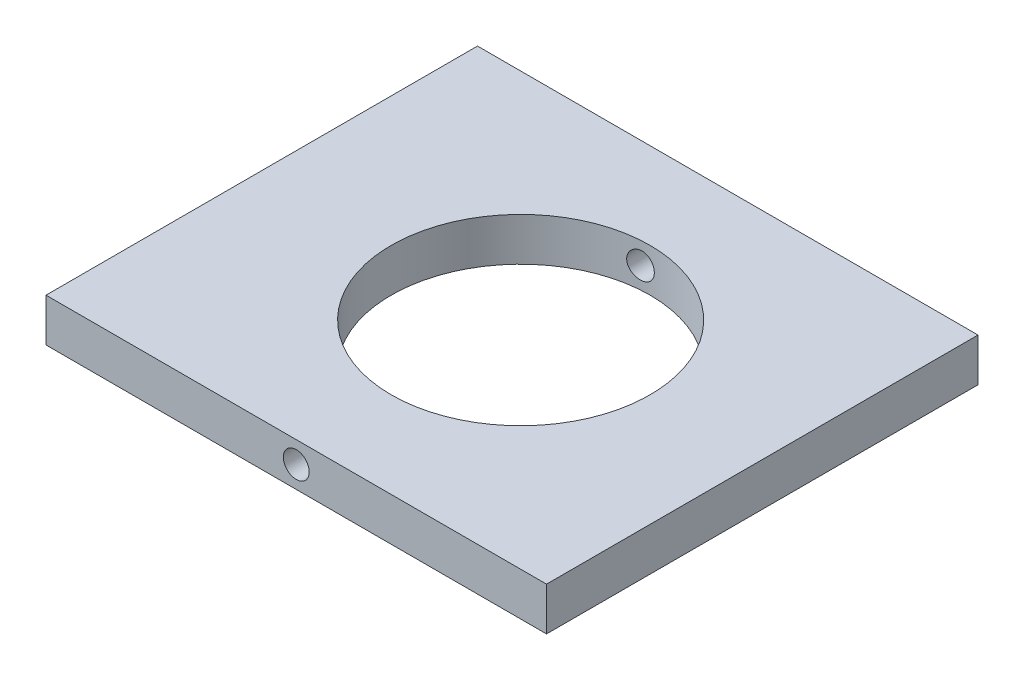
ISO-10303-21;
HEADER;
FILE_DESCRIPTION(('STEP AP214'),'2;1');
FILE_NAME('part.step','',(''),(''),'','','');
FILE_SCHEMA(('AUTOMOTIVE_DESIGN { 1 0 10303 214 1 1 1 1 }'));
ENDSEC;
DATA;
#1=APPLICATION_CONTEXT('core data for automotive mechanical design processes');
#2=APPLICATION_PROTOCOL_DEFINITION('international standard','automotive_design',2000,#1);
#3=PRODUCT_CONTEXT('',#1,'mechanical');
#4=PRODUCT('Part','Part','',(#3));
#5=PRODUCT_RELATED_PRODUCT_CATEGORY('part','',(#4));
#6=PRODUCT_DEFINITION_FORMATION('','',#4);
#7=PRODUCT_DEFINITION_CONTEXT('part definition',#1,'design');
#8=PRODUCT_DEFINITION('design','',#6,#7);
#9=PRODUCT_DEFINITION_SHAPE('','',#8);
#10=(LENGTH_UNIT() NAMED_UNIT(*) SI_UNIT(.MILLI.,.METRE.));
#11=(NAMED_UNIT(*) PLANE_ANGLE_UNIT() SI_UNIT($,.RADIAN.));
#12=(NAMED_UNIT(*) SI_UNIT($,.STERADIAN.) SOLID_ANGLE_UNIT());
#13=UNCERTAINTY_MEASURE_WITH_UNIT(LENGTH_MEASURE(1.E-05),#10,'distance_accuracy_value','');
#14=(GEOMETRIC_REPRESENTATION_CONTEXT(3) GLOBAL_UNCERTAINTY_ASSIGNED_CONTEXT((#13)) GLOBAL_UNIT_ASSIGNED_CONTEXT((#10,
#11,#12)) REPRESENTATION_CONTEXT('',''));
#15=CARTESIAN_POINT('',(0.,0.,0.));
#16=DIRECTION('',(0.,0.,1.));
#17=DIRECTION('',(1.,0.,0.));
#18=AXIS2_PLACEMENT_3D('',#15,#16,#17);
#19=CARTESIAN_POINT('',(-5.5,-45.,50.));
#20=DIRECTION('',(1.,0.,0.));
#21=DIRECTION('',(0.,0.,-1.));
#22=AXIS2_PLACEMENT_3D('',#19,#20,#21);
#23=PLANE('',#22);
#24=DIRECTION('',(0.,-1.,0.));
#25=VECTOR('',#24,1.);
#26=CARTESIAN_POINT('',(-5.5,-45.,0.));
#27=LINE('',#26,#25);
#28=CARTESIAN_POINT('',(-5.5,-45.,0.));
#29=VERTEX_POINT('',#28);
#30=CARTESIAN_POINT('',(-5.5,-50.,0.));
#31=VERTEX_POINT('',#30);
#32=EDGE_CURVE('E108',#29,#31,#27,.T.);
#33=ORIENTED_EDGE('',*,*,#32,.T.);
#34=DIRECTION('',(0.,0.,-1.));
#35=VECTOR('',#34,1.);
#36=CARTESIAN_POINT('',(-5.5,-50.,50.));
#37=LINE('',#36,#35);
#38=CARTESIAN_POINT('',(-5.5,-50.,50.));
#39=VERTEX_POINT('',#38);
#40=EDGE_CURVE('E11',#39,#31,#37,.T.);
#41=ORIENTED_EDGE('',*,*,#40,.F.);
#42=DIRECTION('',(0.,-1.,0.));
#43=VECTOR('',#42,1.);
#44=CARTESIAN_POINT('',(-5.5,-45.,50.));
#45=LINE('',#44,#43);
#46=CARTESIAN_POINT('',(-5.5,-45.,50.));
#47=VERTEX_POINT('',#46);
#48=EDGE_CURVE('E93',#47,#39,#45,.T.);
#49=ORIENTED_EDGE('',*,*,#48,.F.);
#50=DIRECTION('',(0.,0.,-1.));
#51=VECTOR('',#50,1.);
#52=CARTESIAN_POINT('',(-5.5,-45.,50.));
#53=LINE('',#52,#51);
#54=EDGE_CURVE('E60',#47,#29,#53,.T.);
#55=ORIENTED_EDGE('',*,*,#54,.T.);
#56=EDGE_LOOP('',(#33,#41,#49,#55));
#57=FACE_BOUND('',#56,.T.);
#58=ADVANCED_FACE('F37',(#57),#23,.F.);
#59=CARTESIAN_POINT('',(-5.5,-50.,50.));
#60=DIRECTION('',(0.,1.,0.));
#61=DIRECTION('',(0.,0.,1.));
#62=AXIS2_PLACEMENT_3D('',#59,#60,#61);
#63=PLANE('',#62);
#64=CARTESIAN_POINT('',(24.5,-50.,25.));
#65=DIRECTION('',(0.,1.,0.));
#66=DIRECTION('',(0.,0.,1.));
#67=AXIS2_PLACEMENT_3D('',#64,#65,#66);
#68=CIRCLE('',#67,15.);
#69=CARTESIAN_POINT('',(24.5,-50.,40.));
#70=VERTEX_POINT('',#69);
#71=EDGE_CURVE('E110',#70,#70,#68,.T.);
#72=ORIENTED_EDGE('',*,*,#71,.T.);
#73=EDGE_LOOP('',(#72));
#74=FACE_BOUND('',#73,.T.);
#75=DIRECTION('',(1.,0.,0.));
#76=VECTOR('',#75,1.);
#77=CARTESIAN_POINT('',(-5.5,-50.,0.));
#78=LINE('',#77,#76);
#79=CARTESIAN_POINT('',(52.5,-50.,0.));
#80=VERTEX_POINT('',#79);
#81=EDGE_CURVE('E98',#31,#80,#78,.T.);
#82=ORIENTED_EDGE('',*,*,#81,.T.);
#83=DIRECTION('',(0.,0.,-1.));
#84=VECTOR('',#83,1.);
#85=CARTESIAN_POINT('',(52.5,-50.,50.));
#86=LINE('',#85,#84);
#87=CARTESIAN_POINT('',(52.5,-50.,50.));
#88=VERTEX_POINT('',#87);
#89=EDGE_CURVE('E51',#88,#80,#86,.T.);
#90=ORIENTED_EDGE('',*,*,#89,.F.);
#91=DIRECTION('',(1.,0.,0.));
#92=VECTOR('',#91,1.);
#93=CARTESIAN_POINT('',(-5.5,-50.,50.));
#94=LINE('',#93,#92);
#95=EDGE_CURVE('E85',#39,#88,#94,.T.);
#96=ORIENTED_EDGE('',*,*,#95,.F.);
#97=ORIENTED_EDGE('',*,*,#40,.T.);
#98=EDGE_LOOP('',(#82,#90,#96,#97));
#99=FACE_BOUND('',#98,.T.);
#100=ADVANCED_FACE('F97',(#74,#99),#63,.F.);
#101=CARTESIAN_POINT('',(52.5,-45.,50.));
#102=DIRECTION('',(1.,0.,0.));
#103=DIRECTION('',(0.,0.,-1.));
#104=AXIS2_PLACEMENT_3D('',#101,#102,#103);
#105=PLANE('',#104);
#106=DIRECTION('',(0.,-1.,0.));
#107=VECTOR('',#106,1.);
#108=CARTESIAN_POINT('',(52.5,-45.,0.));
#109=LINE('',#108,#107);
#110=CARTESIAN_POINT('',(52.5,-45.,0.));
#111=VERTEX_POINT('',#110);
#112=EDGE_CURVE('E112',#111,#80,#109,.T.);
#113=ORIENTED_EDGE('',*,*,#112,.F.);
#114=DIRECTION('',(0.,0.,-1.));
#115=VECTOR('',#114,1.);
#116=CARTESIAN_POINT('',(52.5,-45.,50.));
#117=LINE('',#116,#115);
#118=CARTESIAN_POINT('',(52.5,-45.,50.));
#119=VERTEX_POINT('',#118);
#120=EDGE_CURVE('E74',#119,#111,#117,.T.);
#121=ORIENTED_EDGE('',*,*,#120,.F.);
#122=DIRECTION('',(0.,-1.,0.));
#123=VECTOR('',#122,1.);
#124=CARTESIAN_POINT('',(52.5,-45.,50.));
#125=LINE('',#124,#123);
#126=EDGE_CURVE('E92',#119,#88,#125,.T.);
#127=ORIENTED_EDGE('',*,*,#126,.T.);
#128=ORIENTED_EDGE('',*,*,#89,.T.);
#129=EDGE_LOOP('',(#113,#121,#127,#128));
#130=FACE_BOUND('',#129,.T.);
#131=ADVANCED_FACE('F102',(#130),#105,.T.);
#132=CARTESIAN_POINT('',(-5.5,-45.,50.));
#133=DIRECTION('',(0.,1.,0.));
#134=DIRECTION('',(0.,0.,1.));
#135=AXIS2_PLACEMENT_3D('',#132,#133,#134);
#136=PLANE('',#135);
#137=CARTESIAN_POINT('',(24.5,-45.,25.));
#138=DIRECTION('',(0.,1.,0.));
#139=DIRECTION('',(0.,0.,1.));
#140=AXIS2_PLACEMENT_3D('',#137,#138,#139);
#141=CIRCLE('',#140,15.);
#142=CARTESIAN_POINT('',(24.5,-45.,40.));
#143=VERTEX_POINT('',#142);
#144=EDGE_CURVE('E172',#143,#143,#141,.T.);
#145=ORIENTED_EDGE('',*,*,#144,.F.);
#146=EDGE_LOOP('',(#145));
#147=FACE_BOUND('',#146,.T.);
#148=DIRECTION('',(1.,0.,0.));
#149=VECTOR('',#148,1.);
#150=CARTESIAN_POINT('',(-5.5,-45.,0.));
#151=LINE('',#150,#149);
#152=EDGE_CURVE('E114',#29,#111,#151,.T.);
#153=ORIENTED_EDGE('',*,*,#152,.F.);
#154=ORIENTED_EDGE('',*,*,#54,.F.);
#155=DIRECTION('',(1.,0.,0.));
#156=VECTOR('',#155,1.);
#157=CARTESIAN_POINT('',(-5.5,-45.,50.));
#158=LINE('',#157,#156);
#159=EDGE_CURVE('E103',#47,#119,#158,.T.);
#160=ORIENTED_EDGE('',*,*,#159,.T.);
#161=ORIENTED_EDGE('',*,*,#120,.T.);
#162=EDGE_LOOP('',(#153,#154,#160,#161));
#163=FACE_BOUND('',#162,.T.);
#164=ADVANCED_FACE('F146',(#147,#163),#136,.T.);
#165=CARTESIAN_POINT('',(0.,0.,50.));
#166=DIRECTION('',(0.,0.,1.));
#167=DIRECTION('',(1.,0.,0.));
#168=AXIS2_PLACEMENT_3D('',#165,#166,#167);
#169=PLANE('',#168);
#170=CARTESIAN_POINT('',(23.5,-47.5,50.));
#171=DIRECTION('',(0.,0.,1.));
#172=DIRECTION('',(1.,0.,0.));
#173=AXIS2_PLACEMENT_3D('',#170,#171,#172);
#174=CIRCLE('',#173,1.5);
#175=CARTESIAN_POINT('',(25.,-47.5,50.));
#176=VERTEX_POINT('',#175);
#177=EDGE_CURVE('E166',#176,#176,#174,.T.);
#178=ORIENTED_EDGE('',*,*,#177,.F.);
#179=EDGE_LOOP('',(#178));
#180=FACE_BOUND('',#179,.T.);
#181=ORIENTED_EDGE('',*,*,#48,.T.);
#182=ORIENTED_EDGE('',*,*,#95,.T.);
#183=ORIENTED_EDGE('',*,*,#126,.F.);
#184=ORIENTED_EDGE('',*,*,#159,.F.);
#185=EDGE_LOOP('',(#181,#182,#183,#184));
#186=FACE_BOUND('',#185,.T.);
#187=ADVANCED_FACE('F89',(#180,#186),#169,.T.);
#188=CARTESIAN_POINT('',(0.,0.,0.));
#189=DIRECTION('',(0.,0.,1.));
#190=DIRECTION('',(1.,0.,0.));
#191=AXIS2_PLACEMENT_3D('',#188,#189,#190);
#192=PLANE('',#191);
#193=CARTESIAN_POINT('',(23.5,-47.5,0.));
#194=DIRECTION('',(0.,0.,1.));
#195=DIRECTION('',(1.,0.,0.));
#196=AXIS2_PLACEMENT_3D('',#193,#194,#195);
#197=CIRCLE('',#196,1.5);
#198=CARTESIAN_POINT('',(25.,-47.5,0.));
#199=VERTEX_POINT('',#198);
#200=EDGE_CURVE('E123',#199,#199,#197,.T.);
#201=ORIENTED_EDGE('',*,*,#200,.T.);
#202=EDGE_LOOP('',(#201));
#203=FACE_BOUND('',#202,.T.);
#204=ORIENTED_EDGE('',*,*,#32,.F.);
#205=ORIENTED_EDGE('',*,*,#152,.T.);
#206=ORIENTED_EDGE('',*,*,#112,.T.);
#207=ORIENTED_EDGE('',*,*,#81,.F.);
#208=EDGE_LOOP('',(#204,#205,#206,#207));
#209=FACE_BOUND('',#208,.T.);
#210=ADVANCED_FACE('F145',(#203,#209),#192,.F.);
#211=CARTESIAN_POINT('',(24.5,-50.,25.));
#212=DIRECTION('',(0.,1.,0.));
#213=DIRECTION('',(0.,0.,1.));
#214=AXIS2_PLACEMENT_3D('',#211,#212,#213);
#215=CYLINDRICAL_SURFACE('',#214,15.);
#216=CARTESIAN_POINT('',(24.5,-48.6180339887499,40.));
#217=CARTESIAN_POINT('',(24.562792353238,-48.5618659776974,39.9999999273094));
#218=CARTESIAN_POINT('',(24.6208838158503,-48.5003581564799,39.9996043563319));
#219=CARTESIAN_POINT('',(24.72595981168,-48.3684181847015,39.9983905695386));
#220=CARTESIAN_POINT('',(24.772931785864,-48.2979760797655,39.9975718791152));
#221=CARTESIAN_POINT('',(24.8543649479623,-48.1502338072452,39.99586905058));
#222=CARTESIAN_POINT('',(24.8888319928025,-48.0729368714198,39.9949849433416));
#223=CARTESIAN_POINT('',(24.9442939822402,-47.9136720731185,39.9934445105049));
#224=CARTESIAN_POINT('',(24.9652921021757,-47.8317053165315,39.9927881312359));
#225=CARTESIAN_POINT('',(24.9932381044238,-47.6653852355015,39.991894956042));
#226=CARTESIAN_POINT('',(25.0001822524607,-47.5810312827931,39.9916582716361));
#227=CARTESIAN_POINT('',(24.9998104507153,-47.4123520030367,39.9916706731326));
#228=CARTESIAN_POINT('',(24.9924940082127,-47.3280266770783,39.9919197758194));
#229=CARTESIAN_POINT('',(24.9638161431028,-47.1618456026428,39.9928341984516));
#230=CARTESIAN_POINT('',(24.9424617981782,-47.0799886314014,39.9934993086447));
#231=CARTESIAN_POINT('',(24.8863217141132,-46.9210199569291,39.9950504711979));
#232=CARTESIAN_POINT('',(24.8515359006039,-46.8439082799752,39.9959365247814));
#233=CARTESIAN_POINT('',(24.7694988309606,-46.6965791515574,39.9976347173306));
#234=CARTESIAN_POINT('',(24.7222416725437,-46.6263649861101,39.9984468210528));
#235=CARTESIAN_POINT('',(24.6166083457938,-46.4948639816127,39.9996394624362));
#236=CARTESIAN_POINT('',(24.5582322156506,-46.4335771119016,40.0000200015798));
#237=CARTESIAN_POINT('',(24.4320393526911,-46.3216914820977,39.9999784211476));
#238=CARTESIAN_POINT('',(24.3642257106856,-46.2710892363641,39.9995565637883));
#239=CARTESIAN_POINT('',(24.2210799042835,-46.1819898565089,39.9975771087919));
#240=CARTESIAN_POINT('',(24.1457478960958,-46.1434924709536,39.9960195347473));
#241=CARTESIAN_POINT('',(23.9899180446766,-46.0797715112282,39.9915266586073));
#242=CARTESIAN_POINT('',(23.9094332194227,-46.0545158613062,39.988594718639));
#243=CARTESIAN_POINT('',(23.7454392678804,-46.0178328573119,39.9812339758208));
#244=CARTESIAN_POINT('',(23.6619301757651,-46.0064053470377,39.9768051898798));
#245=CARTESIAN_POINT('',(23.4943230369783,-45.9976665937383,39.9664845056108));
#246=CARTESIAN_POINT('',(23.4102254049045,-46.0003462508765,39.9605935527908));
#247=CARTESIAN_POINT('',(23.2437533596228,-46.0196756779531,39.9475355154578));
#248=CARTESIAN_POINT('',(23.1613790012947,-46.0363258921081,39.9403683903723));
#249=CARTESIAN_POINT('',(23.0002148174492,-46.0832096888632,39.9250539333135));
#250=CARTESIAN_POINT('',(22.9214460800378,-46.1135141218067,39.9169016530286));
#251=CARTESIAN_POINT('',(22.770129740452,-46.1868514276487,39.9001124404489));
#252=CARTESIAN_POINT('',(22.6975824694957,-46.229884977677,39.8914754823913));
#253=CARTESIAN_POINT('',(22.560210733606,-46.3278382495193,39.8742075878157));
#254=CARTESIAN_POINT('',(22.4954454068788,-46.3828410293132,39.865577139024));
#255=CARTESIAN_POINT('',(22.3760681607444,-46.5030290060947,39.8489916746371));
#256=CARTESIAN_POINT('',(22.321456317729,-46.5682142796855,39.841036664124));
#257=CARTESIAN_POINT('',(22.2239861605324,-46.7069241677782,39.8264020065275));
#258=CARTESIAN_POINT('',(22.1811210921386,-46.780443955538,39.8197216272249));
#259=CARTESIAN_POINT('',(22.1083830987965,-46.9337829426933,39.8081576293496));
#260=CARTESIAN_POINT('',(22.0785092560552,-47.0136016966138,39.8032738838537));
#261=CARTESIAN_POINT('',(22.0329217592396,-47.1763550590977,39.7957445669148));
#262=CARTESIAN_POINT('',(22.0170587060804,-47.2592467230113,39.793075400165));
#263=CARTESIAN_POINT('',(21.99944001645,-47.4265556839183,39.7901075765534));
#264=CARTESIAN_POINT('',(21.9976833974087,-47.5109728742422,39.7898087545877));
#265=CARTESIAN_POINT('',(22.0082758882822,-47.6780268937381,39.7915968474477));
#266=CARTESIAN_POINT('',(22.0204820432474,-47.7606730965288,39.7936595841268));
#267=CARTESIAN_POINT('',(22.0583925626577,-47.9227202250515,39.7999634598376));
#268=CARTESIAN_POINT('',(22.0840970129419,-48.0021211301425,39.8042046127225));
#269=CARTESIAN_POINT('',(22.1483032340545,-48.1556317105165,39.8145393271029));
#270=CARTESIAN_POINT('',(22.1868319027658,-48.2297298633808,39.8206367797408));
#271=CARTESIAN_POINT('',(22.2755567105231,-48.3704352687845,39.8342124511775));
#272=CARTESIAN_POINT('',(22.3257536560549,-48.4370420030609,39.8416907654112));
#273=CARTESIAN_POINT('',(22.4370693925022,-48.5617176741495,39.8575740693727));
#274=CARTESIAN_POINT('',(22.4983104849109,-48.61967616147,39.8659889844142));
#275=CARTESIAN_POINT('',(22.6296001439708,-48.7245254908278,39.8830769488825));
#276=CARTESIAN_POINT('',(22.6996492013782,-48.7714157157517,39.891750012672));
#277=CARTESIAN_POINT('',(22.8472614104589,-48.8531855360378,39.9088569265127));
#278=CARTESIAN_POINT('',(22.9248835810385,-48.8879592273636,39.9172881037536));
#279=CARTESIAN_POINT('',(23.0849570892867,-48.943927864651,39.9333223956186));
#280=CARTESIAN_POINT('',(23.1674082006577,-48.965123446366,39.9409255489985));
#281=CARTESIAN_POINT('',(23.3346056759678,-48.9932561545366,39.9548946501727));
#282=CARTESIAN_POINT('',(23.4193460068746,-49.0002276394919,39.9612635455413));
#283=CARTESIAN_POINT('',(23.588904796731,-48.9997610144627,39.9725456864663));
#284=CARTESIAN_POINT('',(23.6737232670143,-48.9923203055756,39.9774586692985));
#285=CARTESIAN_POINT('',(23.8403540340811,-48.9633056593774,39.9857192995042));
#286=CARTESIAN_POINT('',(23.9221834167737,-48.9418325836234,39.9890778278578));
#287=CARTESIAN_POINT('',(24.0810523350007,-48.8854484515661,39.9943586171885));
#288=CARTESIAN_POINT('',(24.1580971248861,-48.8505524503972,39.9962824802054));
#289=CARTESIAN_POINT('',(24.2797029674199,-48.7826155745908,39.9984597880573));
#290=CARTESIAN_POINT('',(24.3262741867071,-48.7531165454756,39.9990609731497));
#291=CARTESIAN_POINT('',(24.4158998136255,-48.6891835492231,39.9998311023475));
#292=CARTESIAN_POINT('',(24.4589542299064,-48.654749594224,40.000000047516));
#293=CARTESIAN_POINT('',(24.5,-48.6180339887499,40.));
#294=B_SPLINE_CURVE_WITH_KNOTS('',3,(#216,#217,#218,#219,#220,#221,#222,#223,#224,#225,#226,
#227,#228,#229,#230,#231,#232,#233,#234,#235,#236,#237,#238,#239,#240,#241,#242,#243,#244,#245,
#246,#247,#248,#249,#250,#251,#252,#253,#254,#255,#256,#257,#258,#259,#260,#261,#262,#263,#264,
#265,#266,#267,#268,#269,#270,#271,#272,#273,#274,#275,#276,#277,#278,#279,#280,#281,#282,#283,
#284,#285,#286,#287,#288,#289,#290,#291,#292,#293),.UNSPECIFIED.,.T.,.F.,(4,2,2,2,2,2,2,2,2,2,2,
2,2,2,2,2,2,2,2,2,2,2,2,2,2,2,2,2,2,2,2,2,2,2,2,2,2,2,4),(0.,0.252543206012552,
0.505370303251981,0.758078830685039,1.0107277594349,1.26344381062949,1.51616859361576,
1.76876605449305,2.02136491400379,2.2740835354169,2.5268012888428,2.77943647043873,
3.03206640412767,3.28408152599207,3.53609380108175,3.78794353543168,4.03980127805724,
4.29298120960288,4.54617461156697,4.80118445355844,5.05619621408953,5.31106103770037,
5.56590785291206,5.81800319874273,6.07008098496437,6.3196008486299,6.56912229907351,
6.81917043593606,7.06923586072356,7.32226266989589,7.57530358329969,7.83050375721573,
8.08569198129116,8.34026306146166,8.59488005185742,8.84768674836169,9.1002107201396,
9.26529222026119,9.43037331434599),.UNSPECIFIED.);
#295=CARTESIAN_POINT('',(24.5,-48.6180339887499,40.));
#296=VERTEX_POINT('',#295);
#297=EDGE_CURVE('E40',#296,#296,#294,.T.);
#298=ORIENTED_EDGE('',*,*,#297,.T.);
#299=EDGE_LOOP('',(#298));
#300=FACE_BOUND('',#299,.T.);
#301=CARTESIAN_POINT('',(25.,-47.5,10.0083356494351));
#302=CARTESIAN_POINT('',(24.9999964070791,-47.5842499744961,10.0083349118921));
#303=CARTESIAN_POINT('',(24.9928786229047,-47.6685554591201,10.0080928964742));
#304=CARTESIAN_POINT('',(24.964585862334,-47.8348368758247,10.0071899661793));
#305=CARTESIAN_POINT('',(24.9433954392273,-47.9168101447469,10.0065285910318));
#306=CARTESIAN_POINT('',(24.8875624354346,-48.0760027863067,10.0049818002119));
#307=CARTESIAN_POINT('',(24.8529260300543,-48.1532243224277,10.0040964874517));
#308=CARTESIAN_POINT('',(24.7711906244292,-48.3007398392809,10.0023962417037));
#309=CARTESIAN_POINT('',(24.7240943522341,-48.3710353318311,10.0015812933617));
#310=CARTESIAN_POINT('',(24.6187504122749,-48.5027518519266,10.0003778129088));
#311=CARTESIAN_POINT('',(24.5604987516729,-48.5641696880463,9.99998943381575));
#312=CARTESIAN_POINT('',(24.434507814437,-48.676354536589,10.0000109816476));
#313=CARTESIAN_POINT('',(24.3667683329315,-48.7271213189636,10.0004209258132));
#314=CARTESIAN_POINT('',(24.2238475421744,-48.8164865821728,10.002372459673));
#315=CARTESIAN_POINT('',(24.1486777588008,-48.8551035323155,10.0039123197582));
#316=CARTESIAN_POINT('',(23.9929648679635,-48.9191805397952,10.0083698173944));
#317=CARTESIAN_POINT('',(23.9124218871837,-48.9446409072012,10.0112874224723));
#318=CARTESIAN_POINT('',(23.7484626265013,-48.9816590937206,10.0186146503521));
#319=CARTESIAN_POINT('',(23.6650533204193,-48.9932484953246,10.0230208543269));
#320=CARTESIAN_POINT('',(23.4975616761401,-49.0023409897194,10.0332984041684));
#321=CARTESIAN_POINT('',(23.4134793331329,-48.999843981751,10.039169760515));
#322=CARTESIAN_POINT('',(23.2468303259933,-48.9808623951708,10.0522052435257));
#323=CARTESIAN_POINT('',(23.1642672811478,-48.964347964132,10.0593721035229));
#324=CARTESIAN_POINT('',(23.0031360135907,-48.9178010130177,10.0746540147077));
#325=CARTESIAN_POINT('',(22.9245679894165,-48.8877678218399,10.0827691129532));
#326=CARTESIAN_POINT('',(22.7730326409861,-48.8147784316545,10.0995489048332));
#327=CARTESIAN_POINT('',(22.7001102670412,-48.7717297203582,10.1082171702816));
#328=CARTESIAN_POINT('',(22.5625230627467,-48.6739924742659,10.1254916537007));
#329=CARTESIAN_POINT('',(22.4978585586007,-48.6193034798808,10.1340978692076));
#330=CARTESIAN_POINT('',(22.3783275317526,-48.4995203950834,10.150684497705));
#331=CARTESIAN_POINT('',(22.3235057991697,-48.4343811723877,10.1586619616392));
#332=CARTESIAN_POINT('',(22.2255992728763,-48.2956806912995,10.1733496612181));
#333=CARTESIAN_POINT('',(22.1825140802637,-48.2221197192668,10.1800599399295));
#334=CARTESIAN_POINT('',(22.1095940560411,-48.0691284897228,10.1916469238612));
#335=CARTESIAN_POINT('',(22.079678420917,-47.9897376134946,10.1965347816167));
#336=CARTESIAN_POINT('',(22.0336262357457,-47.8269569407916,10.2041373774506));
#337=CARTESIAN_POINT('',(22.0174885245848,-47.7435674819169,10.2068522986485));
#338=CARTESIAN_POINT('',(21.9996083541071,-47.5762606684606,10.2098639676322));
#339=CARTESIAN_POINT('',(21.9976906259962,-47.4923625426949,10.2101901571722));
#340=CARTESIAN_POINT('',(22.0078468602156,-47.3254445552735,10.2084754541555));
#341=CARTESIAN_POINT('',(22.0199203263891,-47.2424246625792,10.2064346455375));
#342=CARTESIAN_POINT('',(22.057592616999,-47.0800286158017,10.2001687729347));
#343=CARTESIAN_POINT('',(22.0831256395972,-47.0006367591001,10.195954337645));
#344=CARTESIAN_POINT('',(22.1469139028716,-46.8472699010219,10.1856818108152));
#345=CARTESIAN_POINT('',(22.1851697019454,-46.7732951375733,10.1796236383551));
#346=CARTESIAN_POINT('',(22.2736637376209,-46.6321914641037,10.1660713405851));
#347=CARTESIAN_POINT('',(22.3239978197091,-46.5651237790124,10.1585658287659));
#348=CARTESIAN_POINT('',(22.435056545862,-46.4403430265539,10.1427072603237));
#349=CARTESIAN_POINT('',(22.4957819324904,-46.382630628291,10.134354143148));
#350=CARTESIAN_POINT('',(22.6267295205059,-46.2774895199334,10.1172831628314));
#351=CARTESIAN_POINT('',(22.6970558595432,-46.2301909602199,10.108562147777));
#352=CARTESIAN_POINT('',(22.8446886983902,-46.1480746776261,10.0914299780804));
#353=CARTESIAN_POINT('',(22.9219953528398,-46.1132572313338,10.0830188303088));
#354=CARTESIAN_POINT('',(23.0817010882264,-46.0570114582541,10.0669867808902));
#355=CARTESIAN_POINT('',(23.1641158652917,-46.0356269020312,10.0593685294464));
#356=CARTESIAN_POINT('',(23.3314742510669,-46.0070819947215,10.045348713314));
#357=CARTESIAN_POINT('',(23.4164177705751,-45.9999211424935,10.0389471057668));
#358=CARTESIAN_POINT('',(23.5858632296555,-46.0000796785806,10.0276414770769));
#359=CARTESIAN_POINT('',(23.6703646469688,-46.0073096865453,10.0227284289871));
#360=CARTESIAN_POINT('',(23.8370168480058,-46.0359075993195,10.0144264124061));
#361=CARTESIAN_POINT('',(23.9191677145388,-46.0572750054307,10.0110373901618));
#362=CARTESIAN_POINT('',(24.0782304210052,-46.1133792679393,10.0057207958412));
#363=CARTESIAN_POINT('',(24.1551721893493,-46.1480304541184,10.0037840892962));
#364=CARTESIAN_POINT('',(24.3021816974751,-46.2297339255415,10.0011240588822));
#365=CARTESIAN_POINT('',(24.3722496903044,-46.2767857540392,10.0004006903302));
#366=CARTESIAN_POINT('',(24.5034826553979,-46.3819265299989,9.99985668507682));
#367=CARTESIAN_POINT('',(24.5646526941452,-46.4400091527555,10.0000355325684));
#368=CARTESIAN_POINT('',(24.6764234915456,-46.5656043426042,10.0009331117728));
#369=CARTESIAN_POINT('',(24.7270217293246,-46.6331191524368,10.0016519720657));
#370=CARTESIAN_POINT('',(24.8163363499664,-46.7758655243833,10.0032690639773));
#371=CARTESIAN_POINT('',(24.8550172869752,-46.8511192357595,10.0041678178249));
#372=CARTESIAN_POINT('',(24.9191674252937,-47.0069967043803,10.0058232114384));
#373=CARTESIAN_POINT('',(24.9446510245009,-47.0876145007113,10.0065800055005));
#374=CARTESIAN_POINT('',(24.9754165237885,-47.2238936448003,10.0075312318259));
#375=CARTESIAN_POINT('',(24.984623040384,-47.2787004113771,10.0078294138403));
#376=CARTESIAN_POINT('',(24.9969159623042,-47.3889967516666,10.0082318656374));
#377=CARTESIAN_POINT('',(25.0000023674339,-47.444486325401,10.008336135414));
#378=CARTESIAN_POINT('',(25.,-47.5,10.0083356494351));
#379=B_SPLINE_CURVE_WITH_KNOTS('',3,(#301,#302,#303,#304,#305,#306,#307,#308,#309,#310,#311,
#312,#313,#314,#315,#316,#317,#318,#319,#320,#321,#322,#323,#324,#325,#326,#327,#328,#329,#330,
#331,#332,#333,#334,#335,#336,#337,#338,#339,#340,#341,#342,#343,#344,#345,#346,#347,#348,#349,
#350,#351,#352,#353,#354,#355,#356,#357,#358,#359,#360,#361,#362,#363,#364,#365,#366,#367,#368,
#369,#370,#371,#372,#373,#374,#375,#376,#377,#378),.UNSPECIFIED.,.T.,.F.,(4,2,2,2,2,2,2,2,2,2,2,
2,2,2,2,2,2,2,2,2,2,2,2,2,2,2,2,2,2,2,2,2,2,2,2,2,2,2,4),(0.,0.252547889507808,
0.505373445209825,0.758083023403272,1.01073731732934,1.26348221316865,1.51623256739877,
1.76859683117048,2.02095514705091,2.27273777416927,2.52452220227428,2.77684419635816,
3.02917871766505,3.28335072948649,3.5375327785491,3.7928436976107,4.04814593806547,
4.3018591310108,4.55555094055121,4.80611058428696,5.05666134292843,5.30599840234663,
5.55534640651252,5.80674261789837,6.05815680159315,6.31255422540461,6.56695728644756,
6.82218506780341,7.07740385660325,7.33104245029174,7.58467209732973,7.83669282078757,
8.08870426300024,8.34057164377351,8.59249901462439,8.84516862083349,9.09756198832219,
9.26396988335051,9.43037778368103),.UNSPECIFIED.);
#380=CARTESIAN_POINT('',(25.,-47.5,10.0083356494351));
#381=VERTEX_POINT('',#380);
#382=EDGE_CURVE('E118',#381,#381,#379,.T.);
#383=ORIENTED_EDGE('',*,*,#382,.T.);
#384=EDGE_LOOP('',(#383));
#385=FACE_BOUND('',#384,.T.);
#386=ORIENTED_EDGE('',*,*,#71,.F.);
#387=EDGE_LOOP('',(#386));
#388=FACE_BOUND('',#387,.T.);
#389=ORIENTED_EDGE('',*,*,#144,.T.);
#390=EDGE_LOOP('',(#389));
#391=FACE_BOUND('',#390,.T.);
#392=ADVANCED_FACE('F124',(#300,#385,#388,#391),#215,.F.);
#393=CARTESIAN_POINT('',(23.5,-47.5,0.));
#394=DIRECTION('',(0.,0.,1.));
#395=DIRECTION('',(1.,0.,0.));
#396=AXIS2_PLACEMENT_3D('',#393,#394,#395);
#397=CYLINDRICAL_SURFACE('',#396,1.5);
#398=ORIENTED_EDGE('',*,*,#200,.F.);
#399=EDGE_LOOP('',(#398));
#400=FACE_BOUND('',#399,.T.);
#401=ORIENTED_EDGE('',*,*,#382,.F.);
#402=EDGE_LOOP('',(#401));
#403=FACE_BOUND('',#402,.T.);
#404=ADVANCED_FACE('F130',(#400,#403),#397,.F.);
#405=ORIENTED_EDGE('',*,*,#177,.T.);
#406=EDGE_LOOP('',(#405));
#407=FACE_BOUND('',#406,.T.);
#408=ORIENTED_EDGE('',*,*,#297,.F.);
#409=EDGE_LOOP('',(#408));
#410=FACE_BOUND('',#409,.T.);
#411=ADVANCED_FACE('F127',(#407,#410),#397,.F.);
#412=CLOSED_SHELL('',(#58,#100,#131,#164,#187,#210,#392,#404,#411));
#413=MANIFOLD_SOLID_BREP('B2',#412);
#414=ADVANCED_BREP_SHAPE_REPRESENTATION('',(#18,#413),#14);
#415=SHAPE_DEFINITION_REPRESENTATION(#9,#414);
ENDSEC;
END-ISO-10303-21;
